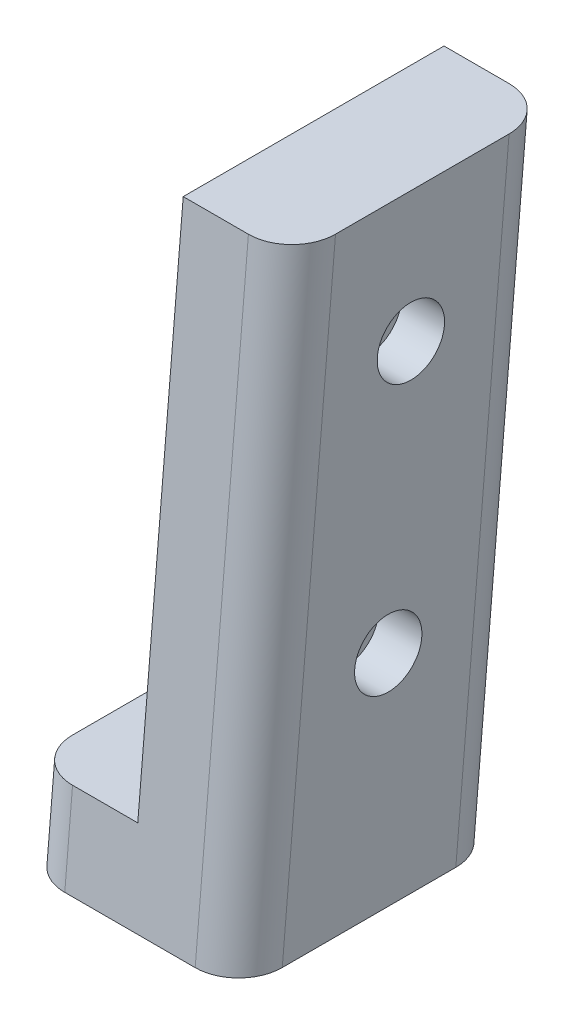
ISO-10303-21;
HEADER;
FILE_DESCRIPTION(('STEP AP214'),'2;1');
FILE_NAME('part.step','',(''),(''),'','','');
FILE_SCHEMA(('AUTOMOTIVE_DESIGN { 1 0 10303 214 1 1 1 1 }'));
ENDSEC;
DATA;
#1=APPLICATION_CONTEXT('core data for automotive mechanical design processes');
#2=APPLICATION_PROTOCOL_DEFINITION('international standard','automotive_design',2000,#1);
#3=PRODUCT_CONTEXT('',#1,'mechanical');
#4=PRODUCT('Part','Part','',(#3));
#5=PRODUCT_RELATED_PRODUCT_CATEGORY('part','',(#4));
#6=PRODUCT_DEFINITION_FORMATION('','',#4);
#7=PRODUCT_DEFINITION_CONTEXT('part definition',#1,'design');
#8=PRODUCT_DEFINITION('design','',#6,#7);
#9=PRODUCT_DEFINITION_SHAPE('','',#8);
#10=(LENGTH_UNIT() NAMED_UNIT(*) SI_UNIT(.MILLI.,.METRE.));
#11=(NAMED_UNIT(*) PLANE_ANGLE_UNIT() SI_UNIT($,.RADIAN.));
#12=(NAMED_UNIT(*) SI_UNIT($,.STERADIAN.) SOLID_ANGLE_UNIT());
#13=UNCERTAINTY_MEASURE_WITH_UNIT(LENGTH_MEASURE(1.E-05),#10,'distance_accuracy_value','');
#14=(GEOMETRIC_REPRESENTATION_CONTEXT(3) GLOBAL_UNCERTAINTY_ASSIGNED_CONTEXT((#13)) GLOBAL_UNIT_ASSIGNED_CONTEXT((#10,
#11,#12)) REPRESENTATION_CONTEXT('',''));
#15=CARTESIAN_POINT('',(0.,0.,0.));
#16=DIRECTION('',(0.,0.,1.));
#17=DIRECTION('',(1.,0.,0.));
#18=AXIS2_PLACEMENT_3D('',#15,#16,#17);
#19=CARTESIAN_POINT('',(0.,155.228318114495,-76.2099125886233));
#20=DIRECTION('',(1.,0.,0.));
#21=DIRECTION('',(0.,0.,-1.));
#22=AXIS2_PLACEMENT_3D('',#19,#20,#21);
#23=CYLINDRICAL_SURFACE('',#22,2.375);
#24=CARTESIAN_POINT('',(12.5,155.228318114495,-76.2099125886233));
#25=DIRECTION('',(-1.,0.,0.));
#26=DIRECTION('',(0.,0.,1.));
#27=AXIS2_PLACEMENT_3D('',#24,#25,#26);
#28=CIRCLE('',#27,2.375);
#29=CARTESIAN_POINT('',(12.5,155.228318114495,-73.8349125886233));
#30=VERTEX_POINT('',#29);
#31=EDGE_CURVE('E174',#30,#30,#28,.T.);
#32=ORIENTED_EDGE('',*,*,#31,.T.);
#33=EDGE_LOOP('',(#32));
#34=FACE_BOUND('',#33,.T.);
#35=CARTESIAN_POINT('',(20.05,155.228318114495,-76.2099125886233));
#36=DIRECTION('',(1.,0.,0.));
#37=DIRECTION('',(0.,0.,-1.));
#38=AXIS2_PLACEMENT_3D('',#35,#36,#37);
#39=CIRCLE('',#38,2.375);
#40=CARTESIAN_POINT('',(20.05,155.228318114495,-78.5849125886233));
#41=VERTEX_POINT('',#40);
#42=EDGE_CURVE('E178',#41,#41,#39,.F.);
#43=ORIENTED_EDGE('',*,*,#42,.F.);
#44=EDGE_LOOP('',(#43));
#45=FACE_BOUND('',#44,.T.);
#46=ADVANCED_FACE('F54',(#34,#45),#23,.F.);
#47=CARTESIAN_POINT('',(0.,185.,-78.8145972477052));
#48=DIRECTION('',(1.,0.,0.));
#49=DIRECTION('',(0.,0.,-1.));
#50=AXIS2_PLACEMENT_3D('',#47,#48,#49);
#51=CYLINDRICAL_SURFACE('',#50,2.375);
#52=CARTESIAN_POINT('',(12.5,185.,-78.8145972477052));
#53=DIRECTION('',(-1.,0.,0.));
#54=DIRECTION('',(0.,0.,1.));
#55=AXIS2_PLACEMENT_3D('',#52,#53,#54);
#56=CIRCLE('',#55,2.375);
#57=CARTESIAN_POINT('',(12.5,185.,-76.4395972477052));
#58=VERTEX_POINT('',#57);
#59=EDGE_CURVE('E177',#58,#58,#56,.T.);
#60=ORIENTED_EDGE('',*,*,#59,.T.);
#61=EDGE_LOOP('',(#60));
#62=FACE_BOUND('',#61,.T.);
#63=CARTESIAN_POINT('',(20.05,185.,-78.8145972477052));
#64=DIRECTION('',(1.,0.,0.));
#65=DIRECTION('',(0.,0.,-1.));
#66=AXIS2_PLACEMENT_3D('',#63,#64,#65);
#67=CIRCLE('',#66,2.375);
#68=CARTESIAN_POINT('',(20.05,185.,-81.1895972477052));
#69=VERTEX_POINT('',#68);
#70=EDGE_CURVE('E182',#69,#69,#67,.F.);
#71=ORIENTED_EDGE('',*,*,#70,.F.);
#72=EDGE_LOOP('',(#71));
#73=FACE_BOUND('',#72,.T.);
#74=ADVANCED_FACE('F191',(#62,#73),#51,.F.);
#75=CARTESIAN_POINT('',(200.822617039051,30.,-50.2538544011882));
#76=DIRECTION('',(0.,-0.0871557427476512,-0.996194698091746));
#77=DIRECTION('',(0.,0.996194698091746,-0.0871557427476513));
#78=AXIS2_PLACEMENT_3D('',#75,#76,#77);
#79=PLANE('',#78);
#80=DIRECTION('',(0.,-0.996194698091746,0.0871557427476513));
#81=VECTOR('',#80,1.);
#82=CARTESIAN_POINT('',(5.,30.,-50.2538544011882));
#83=LINE('',#82,#81);
#84=CARTESIAN_POINT('',(5.,140.228318114495,-59.897582635735));
#85=VERTEX_POINT('',#84);
#86=CARTESIAN_POINT('',(5.,130.,-59.0027207537799));
#87=VERTEX_POINT('',#86);
#88=EDGE_CURVE('E145',#85,#87,#83,.T.);
#89=ORIENTED_EDGE('',*,*,#88,.T.);
#90=DIRECTION('',(1.,0.,0.));
#91=VECTOR('',#90,1.);
#92=CARTESIAN_POINT('',(200.822617039051,130.,-59.0027207537799));
#93=LINE('',#92,#91);
#94=CARTESIAN_POINT('',(20.,130.,-59.0027207537799));
#95=VERTEX_POINT('',#94);
#96=EDGE_CURVE('E131',#87,#95,#93,.T.);
#97=ORIENTED_EDGE('',*,*,#96,.T.);
#98=DIRECTION('',(0.,0.996194698091746,-0.0871557427476513));
#99=VECTOR('',#98,1.);
#100=CARTESIAN_POINT('',(20.,30.,-50.2538544011882));
#101=LINE('',#100,#99);
#102=CARTESIAN_POINT('',(20.,200.,-65.1269272005941));
#103=VERTEX_POINT('',#102);
#104=EDGE_CURVE('E141',#95,#103,#101,.T.);
#105=ORIENTED_EDGE('',*,*,#104,.T.);
#106=DIRECTION('',(-1.,0.,0.));
#107=VECTOR('',#106,1.);
#108=CARTESIAN_POINT('',(200.822617039051,200.,-65.1269272005941));
#109=LINE('',#108,#107);
#110=CARTESIAN_POINT('',(12.5,200.,-65.1269272005941));
#111=VERTEX_POINT('',#110);
#112=EDGE_CURVE('E253',#103,#111,#109,.T.);
#113=ORIENTED_EDGE('',*,*,#112,.T.);
#114=DIRECTION('',(0.,0.996194698091746,-0.087155742747651));
#115=VECTOR('',#114,1.);
#116=CARTESIAN_POINT('',(12.5,200.,-65.1269272005941));
#117=LINE('',#116,#115);
#118=CARTESIAN_POINT('',(12.5,140.228318114495,-59.897582635735));
#119=VERTEX_POINT('',#118);
#120=EDGE_CURVE('E268',#119,#111,#117,.T.);
#121=ORIENTED_EDGE('',*,*,#120,.F.);
#122=DIRECTION('',(1.,0.,0.));
#123=VECTOR('',#122,1.);
#124=CARTESIAN_POINT('',(0.,140.228318114495,-59.897582635735));
#125=LINE('',#124,#123);
#126=EDGE_CURVE('E263',#85,#119,#125,.T.);
#127=ORIENTED_EDGE('',*,*,#126,.F.);
#128=EDGE_LOOP('',(#89,#97,#105,#113,#121,#127));
#129=FACE_BOUND('',#128,.T.);
#130=ADVANCED_FACE('F139',(#129),#79,.F.);
#131=CARTESIAN_POINT('',(0.,0.,140.));
#132=DIRECTION('',(1.,0.,0.));
#133=DIRECTION('',(0.,0.,-1.));
#134=AXIS2_PLACEMENT_3D('',#131,#132,#133);
#135=PLANE('',#134);
#136=DIRECTION('',(0.,0.996194698091746,-0.0871557427476514));
#137=VECTOR('',#136,1.);
#138=CARTESIAN_POINT('',(0.,-18.4596778018853,-70.9950827676879));
#139=LINE('',#138,#137);
#140=CARTESIAN_POINT('',(0.,140.228318114495,-84.8784834480183));
#141=VERTEX_POINT('',#140);
#142=CARTESIAN_POINT('',(0.,130.,-83.9836215660631));
#143=VERTEX_POINT('',#142);
#144=EDGE_CURVE('E169',#141,#143,#139,.F.);
#145=ORIENTED_EDGE('',*,*,#144,.T.);
#146=DIRECTION('',(0.,0.,1.));
#147=VECTOR('',#146,1.);
#148=CARTESIAN_POINT('',(0.,130.,140.));
#149=LINE('',#148,#147);
#150=CARTESIAN_POINT('',(0.,130.,-64.0218199414966));
#151=VERTEX_POINT('',#150);
#152=EDGE_CURVE('E288',#143,#151,#149,.T.);
#153=ORIENTED_EDGE('',*,*,#152,.T.);
#154=DIRECTION('',(0.,-0.996194698091746,0.0871557427476513));
#155=VECTOR('',#154,1.);
#156=CARTESIAN_POINT('',(0.,-16.726512564358,-51.1849134534222));
#157=LINE('',#156,#155);
#158=CARTESIAN_POINT('',(0.,140.228318114495,-64.9166818234517));
#159=VERTEX_POINT('',#158);
#160=EDGE_CURVE('E76',#151,#159,#157,.F.);
#161=ORIENTED_EDGE('',*,*,#160,.T.);
#162=DIRECTION('',(0.,0.,1.));
#163=VECTOR('',#162,1.);
#164=CARTESIAN_POINT('',(0.,140.228318114495,-89.897582635735));
#165=LINE('',#164,#163);
#166=EDGE_CURVE('E265',#141,#159,#165,.T.);
#167=ORIENTED_EDGE('',*,*,#166,.F.);
#168=EDGE_LOOP('',(#145,#153,#161,#167));
#169=FACE_BOUND('',#168,.T.);
#170=ADVANCED_FACE('F212',(#169),#135,.F.);
#171=CARTESIAN_POINT('',(200.822617039051,200.,-95.1269272005941));
#172=DIRECTION('',(0.,-1.,0.));
#173=DIRECTION('',(0.,0.,-1.));
#174=AXIS2_PLACEMENT_3D('',#171,#172,#173);
#175=PLANE('',#174);
#176=DIRECTION('',(0.,0.,-1.));
#177=VECTOR('',#176,1.);
#178=CARTESIAN_POINT('',(12.5,200.,-95.1269272005941));
#179=LINE('',#178,#177);
#180=CARTESIAN_POINT('',(12.5,200.,-95.1269272005941));
#181=VERTEX_POINT('',#180);
#182=EDGE_CURVE('E266',#111,#181,#179,.T.);
#183=ORIENTED_EDGE('',*,*,#182,.F.);
#184=ORIENTED_EDGE('',*,*,#112,.F.);
#185=CARTESIAN_POINT('',(20.,200.,-70.1460263883108));
#186=DIRECTION('',(0.,-1.,0.));
#187=DIRECTION('',(0.,0.,-1.));
#188=AXIS2_PLACEMENT_3D('',#185,#186,#187);
#189=ELLIPSE('',#188,5.01909918771673,5.);
#190=CARTESIAN_POINT('',(25.,200.,-70.1460263883108));
#191=VERTEX_POINT('',#190);
#192=EDGE_CURVE('E150',#103,#191,#189,.F.);
#193=ORIENTED_EDGE('',*,*,#192,.T.);
#194=DIRECTION('',(0.,0.,-1.));
#195=VECTOR('',#194,1.);
#196=CARTESIAN_POINT('',(25.,200.,-95.1269272005941));
#197=LINE('',#196,#195);
#198=CARTESIAN_POINT('',(25.,200.,-90.1078280128774));
#199=VERTEX_POINT('',#198);
#200=EDGE_CURVE('E154',#191,#199,#197,.T.);
#201=ORIENTED_EDGE('',*,*,#200,.T.);
#202=CARTESIAN_POINT('',(20.,200.,-90.1078280128774));
#203=DIRECTION('',(0.,-1.,0.));
#204=DIRECTION('',(0.,0.,1.));
#205=AXIS2_PLACEMENT_3D('',#202,#203,#204);
#206=ELLIPSE('',#205,5.01909918771673,5.);
#207=CARTESIAN_POINT('',(20.,200.,-95.1269272005941));
#208=VERTEX_POINT('',#207);
#209=EDGE_CURVE('E151',#199,#208,#206,.F.);
#210=ORIENTED_EDGE('',*,*,#209,.T.);
#211=DIRECTION('',(-1.,0.,0.));
#212=VECTOR('',#211,1.);
#213=CARTESIAN_POINT('',(200.822617039051,200.,-95.1269272005941));
#214=LINE('',#213,#212);
#215=EDGE_CURVE('E249',#208,#181,#214,.T.);
#216=ORIENTED_EDGE('',*,*,#215,.T.);
#217=EDGE_LOOP('',(#183,#184,#193,#201,#210,#216));
#218=FACE_BOUND('',#217,.T.);
#219=ADVANCED_FACE('F213',(#218),#175,.F.);
#220=CARTESIAN_POINT('',(200.822617039051,200.,-95.1269272005941));
#221=DIRECTION('',(0.,0.0871557427476514,0.996194698091746));
#222=DIRECTION('',(0.,-0.996194698091746,0.0871557427476514));
#223=AXIS2_PLACEMENT_3D('',#220,#221,#222);
#224=PLANE('',#223);
#225=DIRECTION('',(0.,-0.996194698091746,0.0871557427476514));
#226=VECTOR('',#225,1.);
#227=CARTESIAN_POINT('',(20.,200.,-95.1269272005941));
#228=LINE('',#227,#226);
#229=CARTESIAN_POINT('',(20.,130.,-89.0027207537799));
#230=VERTEX_POINT('',#229);
#231=EDGE_CURVE('E165',#208,#230,#228,.T.);
#232=ORIENTED_EDGE('',*,*,#231,.T.);
#233=DIRECTION('',(-1.,0.,0.));
#234=VECTOR('',#233,1.);
#235=CARTESIAN_POINT('',(200.822617039051,130.,-89.0027207537799));
#236=LINE('',#235,#234);
#237=CARTESIAN_POINT('',(5.,130.,-89.0027207537799));
#238=VERTEX_POINT('',#237);
#239=EDGE_CURVE('E245',#230,#238,#236,.T.);
#240=ORIENTED_EDGE('',*,*,#239,.T.);
#241=DIRECTION('',(0.,0.996194698091746,-0.0871557427476514));
#242=VECTOR('',#241,1.);
#243=CARTESIAN_POINT('',(5.,200.,-95.1269272005941));
#244=LINE('',#243,#242);
#245=CARTESIAN_POINT('',(5.,140.228318114495,-89.897582635735));
#246=VERTEX_POINT('',#245);
#247=EDGE_CURVE('E163',#238,#246,#244,.T.);
#248=ORIENTED_EDGE('',*,*,#247,.T.);
#249=DIRECTION('',(1.,0.,0.));
#250=VECTOR('',#249,1.);
#251=CARTESIAN_POINT('',(0.,140.228318114495,-89.897582635735));
#252=LINE('',#251,#250);
#253=CARTESIAN_POINT('',(12.5,140.228318114495,-89.897582635735));
#254=VERTEX_POINT('',#253);
#255=EDGE_CURVE('E261',#246,#254,#252,.T.);
#256=ORIENTED_EDGE('',*,*,#255,.T.);
#257=DIRECTION('',(0.,-0.996194698091746,0.087155742747651));
#258=VECTOR('',#257,1.);
#259=CARTESIAN_POINT('',(12.5,200.,-95.1269272005941));
#260=LINE('',#259,#258);
#261=EDGE_CURVE('E181',#181,#254,#260,.T.);
#262=ORIENTED_EDGE('',*,*,#261,.F.);
#263=ORIENTED_EDGE('',*,*,#215,.F.);
#264=EDGE_LOOP('',(#232,#240,#248,#256,#262,#263));
#265=FACE_BOUND('',#264,.T.);
#266=ADVANCED_FACE('F216',(#265),#224,.F.);
#267=CARTESIAN_POINT('',(5.,200.435778713738,-90.1459537101354));
#268=DIRECTION('',(0.,0.996194698091746,-0.0871557427476514));
#269=DIRECTION('',(0.,0.0871557427476514,0.996194698091746));
#270=AXIS2_PLACEMENT_3D('',#267,#268,#269);
#271=CYLINDRICAL_SURFACE('',#270,5.);
#272=CARTESIAN_POINT('',(5.,130.,-83.9836215660632));
#273=DIRECTION('',(0.,1.,0.));
#274=DIRECTION('',(0.,0.,-1.));
#275=AXIS2_PLACEMENT_3D('',#272,#273,#274);
#276=ELLIPSE('',#275,5.01909918771673,5.);
#277=EDGE_CURVE('E279',#143,#238,#276,.F.);
#278=ORIENTED_EDGE('',*,*,#277,.F.);
#279=ORIENTED_EDGE('',*,*,#144,.F.);
#280=CARTESIAN_POINT('',(5.,140.228318114495,-84.8784834480183));
#281=DIRECTION('',(0.,1.,0.));
#282=DIRECTION('',(0.,0.,-1.));
#283=AXIS2_PLACEMENT_3D('',#280,#281,#282);
#284=ELLIPSE('',#283,5.01909918771673,5.);
#285=EDGE_CURVE('E256',#141,#246,#284,.F.);
#286=ORIENTED_EDGE('',*,*,#285,.T.);
#287=ORIENTED_EDGE('',*,*,#247,.F.);
#288=EDGE_LOOP('',(#278,#279,#286,#287));
#289=FACE_BOUND('',#288,.T.);
#290=ADVANCED_FACE('F56',(#289),#271,.T.);
#291=CARTESIAN_POINT('',(5.,29.5642212862617,-55.2348278916469));
#292=DIRECTION('',(0.,-0.996194698091746,0.0871557427476513));
#293=DIRECTION('',(0.,-0.0871557427476512,-0.996194698091746));
#294=AXIS2_PLACEMENT_3D('',#291,#292,#293);
#295=CYLINDRICAL_SURFACE('',#294,5.);
#296=CARTESIAN_POINT('',(5.,130.,-64.0218199414966));
#297=DIRECTION('',(0.,1.,0.));
#298=DIRECTION('',(0.,0.,1.));
#299=AXIS2_PLACEMENT_3D('',#296,#297,#298);
#300=ELLIPSE('',#299,5.01909918771673,5.);
#301=EDGE_CURVE('E241',#87,#151,#300,.F.);
#302=ORIENTED_EDGE('',*,*,#301,.F.);
#303=ORIENTED_EDGE('',*,*,#88,.F.);
#304=CARTESIAN_POINT('',(5.,140.228318114495,-64.9166818234517));
#305=DIRECTION('',(0.,1.,0.));
#306=DIRECTION('',(0.,0.,1.));
#307=AXIS2_PLACEMENT_3D('',#304,#305,#306);
#308=ELLIPSE('',#307,5.01909918771673,5.);
#309=EDGE_CURVE('E62',#85,#159,#308,.F.);
#310=ORIENTED_EDGE('',*,*,#309,.T.);
#311=ORIENTED_EDGE('',*,*,#160,.F.);
#312=EDGE_LOOP('',(#302,#303,#310,#311));
#313=FACE_BOUND('',#312,.T.);
#314=ADVANCED_FACE('F225',(#313),#295,.T.);
#315=CARTESIAN_POINT('',(25.,0.,140.));
#316=DIRECTION('',(-1.,0.,0.));
#317=DIRECTION('',(0.,0.,1.));
#318=AXIS2_PLACEMENT_3D('',#315,#316,#317);
#319=PLANE('',#318);
#320=CARTESIAN_POINT('',(25.,185.,-78.8145972477052));
#321=DIRECTION('',(1.,0.,0.));
#322=DIRECTION('',(0.,0.,-1.));
#323=AXIS2_PLACEMENT_3D('',#320,#321,#322);
#324=CIRCLE('',#323,3.875);
#325=CARTESIAN_POINT('',(25.,185.,-82.6895972477052));
#326=VERTEX_POINT('',#325);
#327=EDGE_CURVE('E282',#326,#326,#324,.T.);
#328=ORIENTED_EDGE('',*,*,#327,.F.);
#329=EDGE_LOOP('',(#328));
#330=FACE_BOUND('',#329,.T.);
#331=CARTESIAN_POINT('',(25.,155.228318114495,-76.2099125886233));
#332=DIRECTION('',(1.,0.,0.));
#333=DIRECTION('',(0.,0.,-1.));
#334=AXIS2_PLACEMENT_3D('',#331,#332,#333);
#335=CIRCLE('',#334,3.875);
#336=CARTESIAN_POINT('',(25.,155.228318114495,-80.0849125886233));
#337=VERTEX_POINT('',#336);
#338=EDGE_CURVE('E275',#337,#337,#335,.T.);
#339=ORIENTED_EDGE('',*,*,#338,.F.);
#340=EDGE_LOOP('',(#339));
#341=FACE_BOUND('',#340,.T.);
#342=DIRECTION('',(0.,0.996194698091746,-0.0871557427476513));
#343=VECTOR('',#342,1.);
#344=CARTESIAN_POINT('',(25.,-16.726512564358,-51.1849134534222));
#345=LINE('',#344,#343);
#346=CARTESIAN_POINT('',(25.,130.,-64.0218199414966));
#347=VERTEX_POINT('',#346);
#348=EDGE_CURVE('E161',#191,#347,#345,.F.);
#349=ORIENTED_EDGE('',*,*,#348,.T.);
#350=DIRECTION('',(0.,0.,-1.));
#351=VECTOR('',#350,1.);
#352=CARTESIAN_POINT('',(25.,130.,140.));
#353=LINE('',#352,#351);
#354=CARTESIAN_POINT('',(25.,130.,-83.9836215660631));
#355=VERTEX_POINT('',#354);
#356=EDGE_CURVE('E68',#347,#355,#353,.T.);
#357=ORIENTED_EDGE('',*,*,#356,.T.);
#358=DIRECTION('',(0.,-0.996194698091746,0.0871557427476514));
#359=VECTOR('',#358,1.);
#360=CARTESIAN_POINT('',(25.,-18.4596778018853,-70.9950827676879));
#361=LINE('',#360,#359);
#362=EDGE_CURVE('E159',#355,#199,#361,.F.);
#363=ORIENTED_EDGE('',*,*,#362,.T.);
#364=ORIENTED_EDGE('',*,*,#200,.F.);
#365=EDGE_LOOP('',(#349,#357,#363,#364));
#366=FACE_BOUND('',#365,.T.);
#367=ADVANCED_FACE('F221',(#330,#341,#366),#319,.F.);
#368=CARTESIAN_POINT('',(20.,200.435778713738,-90.1459537101354));
#369=DIRECTION('',(0.,-0.996194698091746,0.0871557427476514));
#370=DIRECTION('',(0.,-0.0871557427476514,-0.996194698091746));
#371=AXIS2_PLACEMENT_3D('',#368,#369,#370);
#372=CYLINDRICAL_SURFACE('',#371,5.);
#373=CARTESIAN_POINT('',(20.,130.,-83.9836215660632));
#374=DIRECTION('',(0.,1.,0.));
#375=DIRECTION('',(0.,0.,1.));
#376=AXIS2_PLACEMENT_3D('',#373,#374,#375);
#377=ELLIPSE('',#376,5.01909918771673,5.);
#378=EDGE_CURVE('E146',#230,#355,#377,.F.);
#379=ORIENTED_EDGE('',*,*,#378,.F.);
#380=ORIENTED_EDGE('',*,*,#231,.F.);
#381=ORIENTED_EDGE('',*,*,#209,.F.);
#382=ORIENTED_EDGE('',*,*,#362,.F.);
#383=EDGE_LOOP('',(#379,#380,#381,#382));
#384=FACE_BOUND('',#383,.T.);
#385=ADVANCED_FACE('F224',(#384),#372,.T.);
#386=CARTESIAN_POINT('',(20.,29.5642212862617,-55.2348278916469));
#387=DIRECTION('',(0.,0.996194698091746,-0.0871557427476513));
#388=DIRECTION('',(0.,0.0871557427476512,0.996194698091746));
#389=AXIS2_PLACEMENT_3D('',#386,#387,#388);
#390=CYLINDRICAL_SURFACE('',#389,5.);
#391=CARTESIAN_POINT('',(20.,130.,-64.0218199414966));
#392=DIRECTION('',(0.,1.,0.));
#393=DIRECTION('',(0.,0.,-1.));
#394=AXIS2_PLACEMENT_3D('',#391,#392,#393);
#395=ELLIPSE('',#394,5.01909918771673,5.);
#396=EDGE_CURVE('E12',#347,#95,#395,.F.);
#397=ORIENTED_EDGE('',*,*,#396,.F.);
#398=ORIENTED_EDGE('',*,*,#348,.F.);
#399=ORIENTED_EDGE('',*,*,#192,.F.);
#400=ORIENTED_EDGE('',*,*,#104,.F.);
#401=EDGE_LOOP('',(#397,#398,#399,#400));
#402=FACE_BOUND('',#401,.T.);
#403=ADVANCED_FACE('F149',(#402),#390,.T.);
#404=CARTESIAN_POINT('',(0.,140.228318114495,-89.897582635735));
#405=DIRECTION('',(0.,1.,0.));
#406=DIRECTION('',(0.,0.,1.));
#407=AXIS2_PLACEMENT_3D('',#404,#405,#406);
#408=PLANE('',#407);
#409=ORIENTED_EDGE('',*,*,#166,.T.);
#410=ORIENTED_EDGE('',*,*,#309,.F.);
#411=ORIENTED_EDGE('',*,*,#126,.T.);
#412=DIRECTION('',(0.,0.,1.));
#413=VECTOR('',#412,1.);
#414=CARTESIAN_POINT('',(12.5,140.228318114495,-89.897582635735));
#415=LINE('',#414,#413);
#416=EDGE_CURVE('E270',#254,#119,#415,.T.);
#417=ORIENTED_EDGE('',*,*,#416,.F.);
#418=ORIENTED_EDGE('',*,*,#255,.F.);
#419=ORIENTED_EDGE('',*,*,#285,.F.);
#420=EDGE_LOOP('',(#409,#410,#411,#417,#418,#419));
#421=FACE_BOUND('',#420,.T.);
#422=ADVANCED_FACE('F205',(#421),#408,.T.);
#423=CARTESIAN_POINT('',(12.5,0.,0.));
#424=DIRECTION('',(-1.,0.,0.));
#425=DIRECTION('',(0.,0.,1.));
#426=AXIS2_PLACEMENT_3D('',#423,#424,#425);
#427=PLANE('',#426);
#428=ORIENTED_EDGE('',*,*,#59,.F.);
#429=EDGE_LOOP('',(#428));
#430=FACE_BOUND('',#429,.T.);
#431=ORIENTED_EDGE('',*,*,#31,.F.);
#432=EDGE_LOOP('',(#431));
#433=FACE_BOUND('',#432,.T.);
#434=ORIENTED_EDGE('',*,*,#261,.T.);
#435=ORIENTED_EDGE('',*,*,#416,.T.);
#436=ORIENTED_EDGE('',*,*,#120,.T.);
#437=ORIENTED_EDGE('',*,*,#182,.T.);
#438=EDGE_LOOP('',(#434,#435,#436,#437));
#439=FACE_BOUND('',#438,.T.);
#440=ADVANCED_FACE('F201',(#430,#433,#439),#427,.T.);
#441=CARTESIAN_POINT('',(20.05,185.,-78.8145972477052));
#442=DIRECTION('',(1.,0.,0.));
#443=DIRECTION('',(0.,0.,-1.));
#444=AXIS2_PLACEMENT_3D('',#441,#442,#443);
#445=PLANE('',#444);
#446=CARTESIAN_POINT('',(20.05,185.,-78.8145972477052));
#447=DIRECTION('',(1.,0.,0.));
#448=DIRECTION('',(0.,0.,-1.));
#449=AXIS2_PLACEMENT_3D('',#446,#447,#448);
#450=CIRCLE('',#449,3.875);
#451=CARTESIAN_POINT('',(20.05,185.,-82.6895972477052));
#452=VERTEX_POINT('',#451);
#453=EDGE_CURVE('E184',#452,#452,#450,.T.);
#454=ORIENTED_EDGE('',*,*,#453,.T.);
#455=EDGE_LOOP('',(#454));
#456=FACE_BOUND('',#455,.T.);
#457=ORIENTED_EDGE('',*,*,#70,.T.);
#458=EDGE_LOOP('',(#457));
#459=FACE_BOUND('',#458,.T.);
#460=ADVANCED_FACE('F204',(#456,#459),#445,.T.);
#461=CARTESIAN_POINT('',(20.05,185.,-78.8145972477052));
#462=DIRECTION('',(1.,0.,0.));
#463=DIRECTION('',(0.,0.,-1.));
#464=AXIS2_PLACEMENT_3D('',#461,#462,#463);
#465=CYLINDRICAL_SURFACE('',#464,3.875);
#466=CARTESIAN_POINT('',(20.05,185.,-82.6895972477052));
#467=CARTESIAN_POINT('',(20.1015625,185.,-82.6895972477052));
#468=CARTESIAN_POINT('',(20.153125,185.,-82.6895972477052));
#469=CARTESIAN_POINT('',(20.25625,185.,-82.6895972477052));
#470=CARTESIAN_POINT('',(20.3078125,185.,-82.6895972477052));
#471=CARTESIAN_POINT('',(20.4109375,185.,-82.6895972477052));
#472=CARTESIAN_POINT('',(20.4625,185.,-82.6895972477052));
#473=CARTESIAN_POINT('',(20.565625,185.,-82.6895972477052));
#474=CARTESIAN_POINT('',(20.6171875,185.,-82.6895972477052));
#475=CARTESIAN_POINT('',(20.7203125,185.,-82.6895972477052));
#476=CARTESIAN_POINT('',(20.771875,185.,-82.6895972477052));
#477=CARTESIAN_POINT('',(20.875,185.,-82.6895972477052));
#478=CARTESIAN_POINT('',(20.9265625,185.,-82.6895972477052));
#479=CARTESIAN_POINT('',(21.0296875,185.,-82.6895972477052));
#480=CARTESIAN_POINT('',(21.08125,185.,-82.6895972477052));
#481=CARTESIAN_POINT('',(21.184375,185.,-82.6895972477052));
#482=CARTESIAN_POINT('',(21.2359375,185.,-82.6895972477052));
#483=CARTESIAN_POINT('',(21.3390625,185.,-82.6895972477052));
#484=CARTESIAN_POINT('',(21.390625,185.,-82.6895972477052));
#485=CARTESIAN_POINT('',(21.49375,185.,-82.6895972477052));
#486=CARTESIAN_POINT('',(21.5453125,185.,-82.6895972477052));
#487=CARTESIAN_POINT('',(21.6484375,185.,-82.6895972477052));
#488=CARTESIAN_POINT('',(21.7,185.,-82.6895972477052));
#489=CARTESIAN_POINT('',(21.803125,185.,-82.6895972477052));
#490=CARTESIAN_POINT('',(21.8546875,185.,-82.6895972477052));
#491=CARTESIAN_POINT('',(21.9578125,185.,-82.6895972477052));
#492=CARTESIAN_POINT('',(22.009375,185.,-82.6895972477052));
#493=CARTESIAN_POINT('',(22.1125,185.,-82.6895972477052));
#494=CARTESIAN_POINT('',(22.1640625,185.,-82.6895972477052));
#495=CARTESIAN_POINT('',(22.2671875,185.,-82.6895972477052));
#496=CARTESIAN_POINT('',(22.31875,185.,-82.6895972477052));
#497=CARTESIAN_POINT('',(22.421875,185.,-82.6895972477052));
#498=CARTESIAN_POINT('',(22.4734375,185.,-82.6895972477052));
#499=CARTESIAN_POINT('',(22.5765625,185.,-82.6895972477052));
#500=CARTESIAN_POINT('',(22.628125,185.,-82.6895972477052));
#501=CARTESIAN_POINT('',(22.73125,185.,-82.6895972477052));
#502=CARTESIAN_POINT('',(22.7828125,185.,-82.6895972477052));
#503=CARTESIAN_POINT('',(22.8859375,185.,-82.6895972477052));
#504=CARTESIAN_POINT('',(22.9375,185.,-82.6895972477052));
#505=CARTESIAN_POINT('',(23.040625,185.,-82.6895972477052));
#506=CARTESIAN_POINT('',(23.0921875,185.,-82.6895972477052));
#507=CARTESIAN_POINT('',(23.1953125,185.,-82.6895972477052));
#508=CARTESIAN_POINT('',(23.246875,185.,-82.6895972477052));
#509=CARTESIAN_POINT('',(23.35,185.,-82.6895972477052));
#510=CARTESIAN_POINT('',(23.4015625,185.,-82.6895972477052));
#511=CARTESIAN_POINT('',(23.5046875,185.,-82.6895972477052));
#512=CARTESIAN_POINT('',(23.55625,185.,-82.6895972477052));
#513=CARTESIAN_POINT('',(23.659375,185.,-82.6895972477052));
#514=CARTESIAN_POINT('',(23.7109375,185.,-82.6895972477052));
#515=CARTESIAN_POINT('',(23.8140625,185.,-82.6895972477052));
#516=CARTESIAN_POINT('',(23.865625,185.,-82.6895972477052));
#517=CARTESIAN_POINT('',(23.96875,185.,-82.6895972477052));
#518=CARTESIAN_POINT('',(24.0203125,185.,-82.6895972477052));
#519=CARTESIAN_POINT('',(24.1234375,185.,-82.6895972477052));
#520=CARTESIAN_POINT('',(24.175,185.,-82.6895972477052));
#521=CARTESIAN_POINT('',(24.278125,185.,-82.6895972477052));
#522=CARTESIAN_POINT('',(24.3296875,185.,-82.6895972477052));
#523=CARTESIAN_POINT('',(24.4328125,185.,-82.6895972477052));
#524=CARTESIAN_POINT('',(24.484375,185.,-82.6895972477052));
#525=CARTESIAN_POINT('',(24.5875,185.,-82.6895972477052));
#526=CARTESIAN_POINT('',(24.6390625,185.,-82.6895972477052));
#527=CARTESIAN_POINT('',(24.7421875,185.,-82.6895972477052));
#528=CARTESIAN_POINT('',(24.79375,185.,-82.6895972477052));
#529=CARTESIAN_POINT('',(24.896875,185.,-82.6895972477052));
#530=CARTESIAN_POINT('',(24.9484375,185.,-82.6895972477052));
#531=CARTESIAN_POINT('',(25.,185.,-82.6895972477052));
#532=B_SPLINE_CURVE_WITH_KNOTS('',3,(#466,#467,#468,#469,#470,#471,#472,#473,#474,#475,#476,
#477,#478,#479,#480,#481,#482,#483,#484,#485,#486,#487,#488,#489,#490,#491,#492,#493,#494,#495,
#496,#497,#498,#499,#500,#501,#502,#503,#504,#505,#506,#507,#508,#509,#510,#511,#512,#513,#514,
#515,#516,#517,#518,#519,#520,#521,#522,#523,#524,#525,#526,#527,#528,#529,#530,#531),
.UNSPECIFIED.,.F.,.F.,(4,2,2,2,2,2,2,2,2,2,2,2,2,2,2,2,2,2,2,2,2,2,2,2,2,2,2,2,2,2,2,2,4),(0.,
0.154687499999997,0.309374999999997,0.464062499999997,0.618749999999998,0.773437499999998,
0.928124999999998,1.0828125,1.2375,1.3921875,1.546875,1.7015625,1.85625,2.0109375,2.165625,
2.3203125,2.475,2.6296875,2.784375,2.9390625,3.09375,3.2484375,3.403125,3.5578125,3.7125,
3.8671875,4.021875,4.1765625,4.33125,4.4859375,4.640625,4.7953125,4.95),.UNSPECIFIED.);
#533=EDGE_CURVE('BSEAM348',#452,#326,#532,.T.);
#534=ORIENTED_EDGE('',*,*,#453,.F.);
#535=ORIENTED_EDGE('',*,*,#327,.T.);
#536=ORIENTED_EDGE('',*,*,#533,.T.);
#537=ORIENTED_EDGE('',*,*,#533,.F.);
#538=EDGE_LOOP('',(#534,#536,#535,#537));
#539=FACE_BOUND('',#538,.T.);
#540=ADVANCED_FACE('F348',(#539),#465,.F.);
#541=CARTESIAN_POINT('',(20.05,155.228318114495,-76.2099125886233));
#542=DIRECTION('',(1.,0.,0.));
#543=DIRECTION('',(0.,0.,-1.));
#544=AXIS2_PLACEMENT_3D('',#541,#542,#543);
#545=PLANE('',#544);
#546=CARTESIAN_POINT('',(20.05,155.228318114495,-76.2099125886233));
#547=DIRECTION('',(1.,0.,0.));
#548=DIRECTION('',(0.,0.,-1.));
#549=AXIS2_PLACEMENT_3D('',#546,#547,#548);
#550=CIRCLE('',#549,3.875);
#551=CARTESIAN_POINT('',(20.05,155.228318114495,-80.0849125886233));
#552=VERTEX_POINT('',#551);
#553=EDGE_CURVE('E278',#552,#552,#550,.T.);
#554=ORIENTED_EDGE('',*,*,#553,.T.);
#555=EDGE_LOOP('',(#554));
#556=FACE_BOUND('',#555,.T.);
#557=ORIENTED_EDGE('',*,*,#42,.T.);
#558=EDGE_LOOP('',(#557));
#559=FACE_BOUND('',#558,.T.);
#560=ADVANCED_FACE('F188',(#556,#559),#545,.T.);
#561=CARTESIAN_POINT('',(20.05,155.228318114495,-76.2099125886233));
#562=DIRECTION('',(1.,0.,0.));
#563=DIRECTION('',(0.,0.,-1.));
#564=AXIS2_PLACEMENT_3D('',#561,#562,#563);
#565=CYLINDRICAL_SURFACE('',#564,3.875);
#566=CARTESIAN_POINT('',(20.05,155.228318114495,-80.0849125886233));
#567=CARTESIAN_POINT('',(20.1015625,155.228318114495,-80.0849125886233));
#568=CARTESIAN_POINT('',(20.153125,155.228318114495,-80.0849125886233));
#569=CARTESIAN_POINT('',(20.25625,155.228318114495,-80.0849125886233));
#570=CARTESIAN_POINT('',(20.3078125,155.228318114495,-80.0849125886233));
#571=CARTESIAN_POINT('',(20.4109375,155.228318114495,-80.0849125886233));
#572=CARTESIAN_POINT('',(20.4625,155.228318114495,-80.0849125886233));
#573=CARTESIAN_POINT('',(20.565625,155.228318114495,-80.0849125886233));
#574=CARTESIAN_POINT('',(20.6171875,155.228318114495,-80.0849125886233));
#575=CARTESIAN_POINT('',(20.7203125,155.228318114495,-80.0849125886233));
#576=CARTESIAN_POINT('',(20.771875,155.228318114495,-80.0849125886233));
#577=CARTESIAN_POINT('',(20.875,155.228318114495,-80.0849125886233));
#578=CARTESIAN_POINT('',(20.9265625,155.228318114495,-80.0849125886233));
#579=CARTESIAN_POINT('',(21.0296875,155.228318114495,-80.0849125886233));
#580=CARTESIAN_POINT('',(21.08125,155.228318114495,-80.0849125886233));
#581=CARTESIAN_POINT('',(21.184375,155.228318114495,-80.0849125886233));
#582=CARTESIAN_POINT('',(21.2359375,155.228318114495,-80.0849125886233));
#583=CARTESIAN_POINT('',(21.3390625,155.228318114495,-80.0849125886233));
#584=CARTESIAN_POINT('',(21.390625,155.228318114495,-80.0849125886233));
#585=CARTESIAN_POINT('',(21.49375,155.228318114495,-80.0849125886233));
#586=CARTESIAN_POINT('',(21.5453125,155.228318114495,-80.0849125886233));
#587=CARTESIAN_POINT('',(21.6484375,155.228318114495,-80.0849125886233));
#588=CARTESIAN_POINT('',(21.7,155.228318114495,-80.0849125886233));
#589=CARTESIAN_POINT('',(21.803125,155.228318114495,-80.0849125886233));
#590=CARTESIAN_POINT('',(21.8546875,155.228318114495,-80.0849125886233));
#591=CARTESIAN_POINT('',(21.9578125,155.228318114495,-80.0849125886233));
#592=CARTESIAN_POINT('',(22.009375,155.228318114495,-80.0849125886233));
#593=CARTESIAN_POINT('',(22.1125,155.228318114495,-80.0849125886233));
#594=CARTESIAN_POINT('',(22.1640625,155.228318114495,-80.0849125886233));
#595=CARTESIAN_POINT('',(22.2671875,155.228318114495,-80.0849125886233));
#596=CARTESIAN_POINT('',(22.31875,155.228318114495,-80.0849125886233));
#597=CARTESIAN_POINT('',(22.421875,155.228318114495,-80.0849125886233));
#598=CARTESIAN_POINT('',(22.4734375,155.228318114495,-80.0849125886233));
#599=CARTESIAN_POINT('',(22.5765625,155.228318114495,-80.0849125886233));
#600=CARTESIAN_POINT('',(22.628125,155.228318114495,-80.0849125886233));
#601=CARTESIAN_POINT('',(22.73125,155.228318114495,-80.0849125886233));
#602=CARTESIAN_POINT('',(22.7828125,155.228318114495,-80.0849125886233));
#603=CARTESIAN_POINT('',(22.8859375,155.228318114495,-80.0849125886233));
#604=CARTESIAN_POINT('',(22.9375,155.228318114495,-80.0849125886233));
#605=CARTESIAN_POINT('',(23.040625,155.228318114495,-80.0849125886233));
#606=CARTESIAN_POINT('',(23.0921875,155.228318114495,-80.0849125886233));
#607=CARTESIAN_POINT('',(23.1953125,155.228318114495,-80.0849125886233));
#608=CARTESIAN_POINT('',(23.246875,155.228318114495,-80.0849125886233));
#609=CARTESIAN_POINT('',(23.35,155.228318114495,-80.0849125886233));
#610=CARTESIAN_POINT('',(23.4015625,155.228318114495,-80.0849125886233));
#611=CARTESIAN_POINT('',(23.5046875,155.228318114495,-80.0849125886233));
#612=CARTESIAN_POINT('',(23.55625,155.228318114495,-80.0849125886233));
#613=CARTESIAN_POINT('',(23.659375,155.228318114495,-80.0849125886233));
#614=CARTESIAN_POINT('',(23.7109375,155.228318114495,-80.0849125886233));
#615=CARTESIAN_POINT('',(23.8140625,155.228318114495,-80.0849125886233));
#616=CARTESIAN_POINT('',(23.865625,155.228318114495,-80.0849125886233));
#617=CARTESIAN_POINT('',(23.96875,155.228318114495,-80.0849125886233));
#618=CARTESIAN_POINT('',(24.0203125,155.228318114495,-80.0849125886233));
#619=CARTESIAN_POINT('',(24.1234375,155.228318114495,-80.0849125886233));
#620=CARTESIAN_POINT('',(24.175,155.228318114495,-80.0849125886233));
#621=CARTESIAN_POINT('',(24.278125,155.228318114495,-80.0849125886233));
#622=CARTESIAN_POINT('',(24.3296875,155.228318114495,-80.0849125886233));
#623=CARTESIAN_POINT('',(24.4328125,155.228318114495,-80.0849125886233));
#624=CARTESIAN_POINT('',(24.484375,155.228318114495,-80.0849125886233));
#625=CARTESIAN_POINT('',(24.5875,155.228318114495,-80.0849125886233));
#626=CARTESIAN_POINT('',(24.6390625,155.228318114495,-80.0849125886233));
#627=CARTESIAN_POINT('',(24.7421875,155.228318114495,-80.0849125886233));
#628=CARTESIAN_POINT('',(24.79375,155.228318114495,-80.0849125886233));
#629=CARTESIAN_POINT('',(24.896875,155.228318114495,-80.0849125886233));
#630=CARTESIAN_POINT('',(24.9484375,155.228318114495,-80.0849125886233));
#631=CARTESIAN_POINT('',(25.,155.228318114495,-80.0849125886233));
#632=B_SPLINE_CURVE_WITH_KNOTS('',3,(#566,#567,#568,#569,#570,#571,#572,#573,#574,#575,#576,
#577,#578,#579,#580,#581,#582,#583,#584,#585,#586,#587,#588,#589,#590,#591,#592,#593,#594,#595,
#596,#597,#598,#599,#600,#601,#602,#603,#604,#605,#606,#607,#608,#609,#610,#611,#612,#613,#614,
#615,#616,#617,#618,#619,#620,#621,#622,#623,#624,#625,#626,#627,#628,#629,#630,#631),
.UNSPECIFIED.,.F.,.F.,(4,2,2,2,2,2,2,2,2,2,2,2,2,2,2,2,2,2,2,2,2,2,2,2,2,2,2,2,2,2,2,2,4),(0.,
0.154687499999997,0.309374999999997,0.464062499999997,0.618749999999998,0.773437499999998,
0.928124999999998,1.0828125,1.2375,1.3921875,1.546875,1.7015625,1.85625,2.0109375,2.165625,
2.3203125,2.475,2.6296875,2.784375,2.9390625,3.09375,3.2484375,3.403125,3.5578125,3.7125,
3.8671875,4.021875,4.1765625,4.33125,4.4859375,4.640625,4.7953125,4.95),.UNSPECIFIED.);
#633=EDGE_CURVE('BSEAM332',#552,#337,#632,.T.);
#634=ORIENTED_EDGE('',*,*,#553,.F.);
#635=ORIENTED_EDGE('',*,*,#338,.T.);
#636=ORIENTED_EDGE('',*,*,#633,.T.);
#637=ORIENTED_EDGE('',*,*,#633,.F.);
#638=EDGE_LOOP('',(#634,#636,#635,#637));
#639=FACE_BOUND('',#638,.T.);
#640=ADVANCED_FACE('F332',(#639),#565,.F.);
#641=CARTESIAN_POINT('',(0.,130.,0.));
#642=DIRECTION('',(0.,1.,0.));
#643=DIRECTION('',(0.,0.,1.));
#644=AXIS2_PLACEMENT_3D('',#641,#642,#643);
#645=PLANE('',#644);
#646=ORIENTED_EDGE('',*,*,#277,.T.);
#647=ORIENTED_EDGE('',*,*,#239,.F.);
#648=ORIENTED_EDGE('',*,*,#378,.T.);
#649=ORIENTED_EDGE('',*,*,#356,.F.);
#650=ORIENTED_EDGE('',*,*,#396,.T.);
#651=ORIENTED_EDGE('',*,*,#96,.F.);
#652=ORIENTED_EDGE('',*,*,#301,.T.);
#653=ORIENTED_EDGE('',*,*,#152,.F.);
#654=EDGE_LOOP('',(#646,#647,#648,#649,#650,#651,#652,#653));
#655=FACE_BOUND('',#654,.T.);
#656=ADVANCED_FACE('F130',(#655),#645,.F.);
#657=CLOSED_SHELL('',(#46,#74,#130,#170,#219,#266,#290,#314,#367,#385,#403,#422,#440,#460,#540,
#560,#640,#656));
#658=MANIFOLD_SOLID_BREP('B2',#657);
#659=ADVANCED_BREP_SHAPE_REPRESENTATION('',(#18,#658),#14);
#660=SHAPE_DEFINITION_REPRESENTATION(#9,#659);
ENDSEC;
END-ISO-10303-21;
